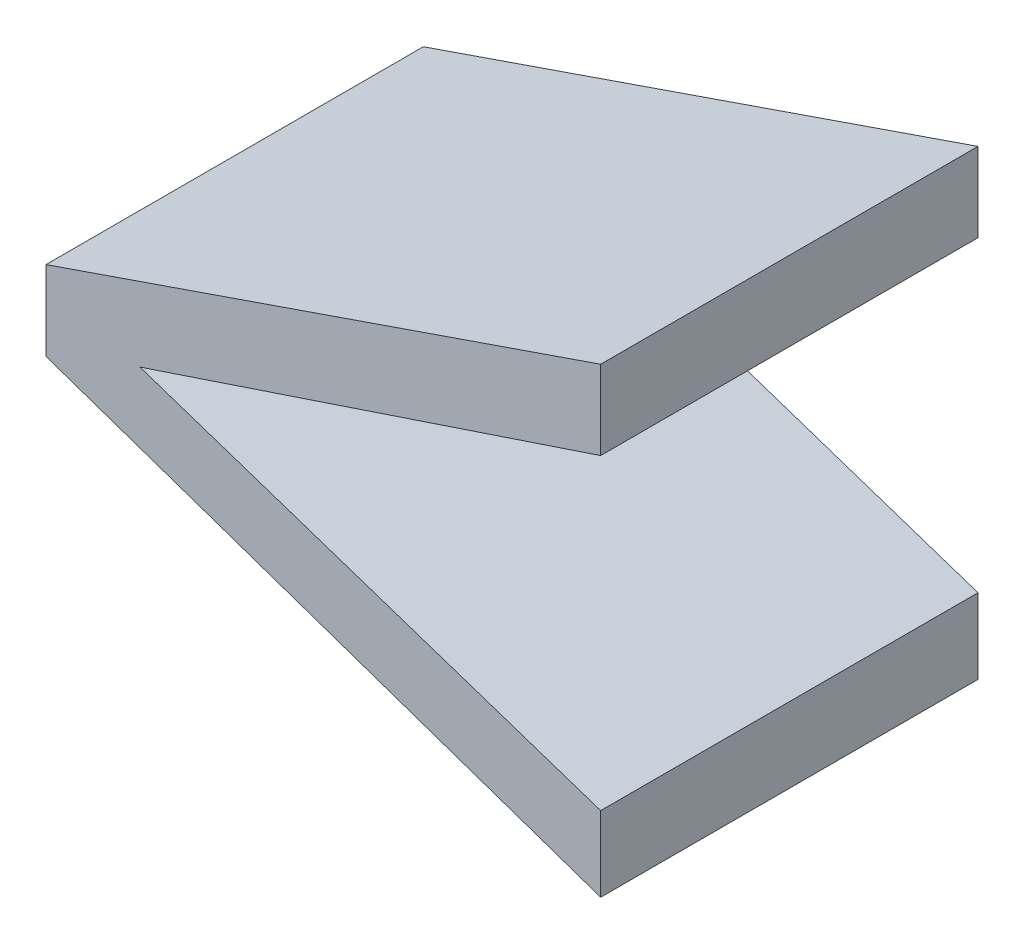
ISO-10303-21;
HEADER;
FILE_DESCRIPTION(('STEP AP214'),'2;1');
FILE_NAME('part.step','',(''),(''),'','','');
FILE_SCHEMA(('AUTOMOTIVE_DESIGN { 1 0 10303 214 1 1 1 1 }'));
ENDSEC;
DATA;
#1=APPLICATION_CONTEXT('core data for automotive mechanical design processes');
#2=APPLICATION_PROTOCOL_DEFINITION('international standard','automotive_design',2000,#1);
#3=PRODUCT_CONTEXT('',#1,'mechanical');
#4=PRODUCT('Part','Part','',(#3));
#5=PRODUCT_RELATED_PRODUCT_CATEGORY('part','',(#4));
#6=PRODUCT_DEFINITION_FORMATION('','',#4);
#7=PRODUCT_DEFINITION_CONTEXT('part definition',#1,'design');
#8=PRODUCT_DEFINITION('design','',#6,#7);
#9=PRODUCT_DEFINITION_SHAPE('','',#8);
#10=(LENGTH_UNIT() NAMED_UNIT(*) SI_UNIT(.MILLI.,.METRE.));
#11=(NAMED_UNIT(*) PLANE_ANGLE_UNIT() SI_UNIT($,.RADIAN.));
#12=(NAMED_UNIT(*) SI_UNIT($,.STERADIAN.) SOLID_ANGLE_UNIT());
#13=UNCERTAINTY_MEASURE_WITH_UNIT(LENGTH_MEASURE(1.E-05),#10,'distance_accuracy_value','');
#14=(GEOMETRIC_REPRESENTATION_CONTEXT(3) GLOBAL_UNCERTAINTY_ASSIGNED_CONTEXT((#13)) GLOBAL_UNIT_ASSIGNED_CONTEXT((#10,
#11,#12)) REPRESENTATION_CONTEXT('',''));
#15=CARTESIAN_POINT('',(0.,0.,0.));
#16=DIRECTION('',(0.,0.,1.));
#17=DIRECTION('',(1.,0.,0.));
#18=AXIS2_PLACEMENT_3D('',#15,#16,#17);
#19=CARTESIAN_POINT('',(-0.198338464719741,-0.802044185635566,0.));
#20=DIRECTION('',(-1.,0.,0.));
#21=DIRECTION('',(0.,-1.,0.));
#22=AXIS2_PLACEMENT_3D('',#19,#20,#21);
#23=PLANE('',#22);
#24=DIRECTION('',(0.,1.,0.));
#25=VECTOR('',#24,1.);
#26=CARTESIAN_POINT('',(-0.198338464719741,-0.823129276362494,0.));
#27=LINE('',#26,#25);
#28=CARTESIAN_POINT('',(-0.198338464719741,-0.823129276362494,0.));
#29=VERTEX_POINT('',#28);
#30=CARTESIAN_POINT('',(-0.198338464719741,-0.802044185635566,0.));
#31=VERTEX_POINT('',#30);
#32=EDGE_CURVE('E11',#29,#31,#27,.T.);
#33=ORIENTED_EDGE('',*,*,#32,.F.);
#34=DIRECTION('',(0.,0.,1.));
#35=VECTOR('',#34,1.);
#36=CARTESIAN_POINT('',(-0.198338464719741,-0.823129276362494,0.));
#37=LINE('',#36,#35);
#38=CARTESIAN_POINT('',(-0.198338464719741,-0.823129276362494,0.1));
#39=VERTEX_POINT('',#38);
#40=EDGE_CURVE('E131',#29,#39,#37,.T.);
#41=ORIENTED_EDGE('',*,*,#40,.T.);
#42=DIRECTION('',(0.,-1.,0.));
#43=VECTOR('',#42,1.);
#44=CARTESIAN_POINT('',(-0.198338464719741,-0.802044185635566,0.1));
#45=LINE('',#44,#43);
#46=CARTESIAN_POINT('',(-0.198338464719741,-0.802044185635566,0.1));
#47=VERTEX_POINT('',#46);
#48=EDGE_CURVE('E97',#47,#39,#45,.T.);
#49=ORIENTED_EDGE('',*,*,#48,.F.);
#50=DIRECTION('',(0.,0.,1.));
#51=VECTOR('',#50,1.);
#52=CARTESIAN_POINT('',(-0.198338464719741,-0.802044185635566,0.));
#53=LINE('',#52,#51);
#54=EDGE_CURVE('E126',#31,#47,#53,.T.);
#55=ORIENTED_EDGE('',*,*,#54,.F.);
#56=EDGE_LOOP('',(#33,#41,#49,#55));
#57=FACE_BOUND('',#56,.T.);
#58=ADVANCED_FACE('F17',(#57),#23,.T.);
#59=CARTESIAN_POINT('',(-0.0513384536630792,-0.751416142929666,0.));
#60=DIRECTION('',(-0.325636464372624,0.945495051848976,0.));
#61=DIRECTION('',(-0.945495051848976,-0.325636464372624,0.));
#62=AXIS2_PLACEMENT_3D('',#59,#60,#61);
#63=PLANE('',#62);
#64=DIRECTION('',(0.945495051848975,0.325636464372624,0.));
#65=VECTOR('',#64,1.);
#66=CARTESIAN_POINT('',(-0.198338464719741,-0.802044185635566,0.));
#67=LINE('',#66,#65);
#68=CARTESIAN_POINT('',(-0.0513384536630792,-0.751416142929666,0.));
#69=VERTEX_POINT('',#68);
#70=EDGE_CURVE('E24',#31,#69,#67,.T.);
#71=ORIENTED_EDGE('',*,*,#70,.F.);
#72=ORIENTED_EDGE('',*,*,#54,.T.);
#73=DIRECTION('',(-0.945495051848975,-0.325636464372624,0.));
#74=VECTOR('',#73,1.);
#75=CARTESIAN_POINT('',(-0.0513384536630795,-0.751416142929665,0.1));
#76=LINE('',#75,#74);
#77=CARTESIAN_POINT('',(-0.0513384536630792,-0.751416142929666,0.1));
#78=VERTEX_POINT('',#77);
#79=EDGE_CURVE('E118',#78,#47,#76,.T.);
#80=ORIENTED_EDGE('',*,*,#79,.F.);
#81=DIRECTION('',(0.,0.,1.));
#82=VECTOR('',#81,1.);
#83=CARTESIAN_POINT('',(-0.0513384536630792,-0.751416142929666,0.));
#84=LINE('',#83,#82);
#85=EDGE_CURVE('E120',#69,#78,#84,.T.);
#86=ORIENTED_EDGE('',*,*,#85,.F.);
#87=EDGE_LOOP('',(#71,#72,#80,#86));
#88=FACE_BOUND('',#87,.T.);
#89=ADVANCED_FACE('F136',(#88),#63,.T.);
#90=CARTESIAN_POINT('',(-0.0513384536630791,-0.772382108850227,0.));
#91=DIRECTION('',(1.,0.,0.));
#92=DIRECTION('',(0.,1.,0.));
#93=AXIS2_PLACEMENT_3D('',#90,#91,#92);
#94=PLANE('',#93);
#95=DIRECTION('',(0.,-1.,0.));
#96=VECTOR('',#95,1.);
#97=CARTESIAN_POINT('',(-0.0513384536630792,-0.751416142929666,0.));
#98=LINE('',#97,#96);
#99=CARTESIAN_POINT('',(-0.0513384536630791,-0.772382108850227,0.));
#100=VERTEX_POINT('',#99);
#101=EDGE_CURVE('E128',#69,#100,#98,.T.);
#102=ORIENTED_EDGE('',*,*,#101,.F.);
#103=ORIENTED_EDGE('',*,*,#85,.T.);
#104=DIRECTION('',(0.,1.,0.));
#105=VECTOR('',#104,1.);
#106=CARTESIAN_POINT('',(-0.0513384536630791,-0.772382108850227,0.1));
#107=LINE('',#106,#105);
#108=CARTESIAN_POINT('',(-0.0513384536630791,-0.772382108850227,0.1));
#109=VERTEX_POINT('',#108);
#110=EDGE_CURVE('E110',#109,#78,#107,.T.);
#111=ORIENTED_EDGE('',*,*,#110,.F.);
#112=DIRECTION('',(0.,0.,1.));
#113=VECTOR('',#112,1.);
#114=CARTESIAN_POINT('',(-0.0513384536630791,-0.772382108850227,0.));
#115=LINE('',#114,#113);
#116=EDGE_CURVE('E113',#100,#109,#115,.T.);
#117=ORIENTED_EDGE('',*,*,#116,.F.);
#118=EDGE_LOOP('',(#102,#103,#111,#117));
#119=FACE_BOUND('',#118,.T.);
#120=ADVANCED_FACE('F138',(#119),#94,.T.);
#121=CARTESIAN_POINT('',(-0.173441380189074,-0.813122792627681,0.));
#122=DIRECTION('',(0.316505388780875,-0.948590711989458,0.));
#123=DIRECTION('',(0.948590711989458,0.316505388780875,0.));
#124=AXIS2_PLACEMENT_3D('',#121,#122,#123);
#125=PLANE('',#124);
#126=DIRECTION('',(-0.948590711989458,-0.316505388780874,0.));
#127=VECTOR('',#126,1.);
#128=CARTESIAN_POINT('',(-0.0513384536630791,-0.772382108850227,0.));
#129=LINE('',#128,#127);
#130=CARTESIAN_POINT('',(-0.173441380189074,-0.813122792627681,0.));
#131=VERTEX_POINT('',#130);
#132=EDGE_CURVE('E122',#100,#131,#129,.T.);
#133=ORIENTED_EDGE('',*,*,#132,.F.);
#134=ORIENTED_EDGE('',*,*,#116,.T.);
#135=DIRECTION('',(0.948590711989458,0.316505388780875,0.));
#136=VECTOR('',#135,1.);
#137=CARTESIAN_POINT('',(-0.173441380189074,-0.813122792627681,0.1));
#138=LINE('',#137,#136);
#139=CARTESIAN_POINT('',(-0.173441380189074,-0.813122792627681,0.1));
#140=VERTEX_POINT('',#139);
#141=EDGE_CURVE('E103',#140,#109,#138,.T.);
#142=ORIENTED_EDGE('',*,*,#141,.F.);
#143=DIRECTION('',(0.,0.,1.));
#144=VECTOR('',#143,1.);
#145=CARTESIAN_POINT('',(-0.173441380189074,-0.813122792627681,0.));
#146=LINE('',#145,#144);
#147=EDGE_CURVE('E106',#131,#140,#146,.T.);
#148=ORIENTED_EDGE('',*,*,#147,.F.);
#149=EDGE_LOOP('',(#133,#134,#142,#148));
#150=FACE_BOUND('',#149,.T.);
#151=ADVANCED_FACE('F142',(#150),#125,.T.);
#152=CARTESIAN_POINT('',(-0.0513384536630789,-0.853863476405135,0.));
#153=DIRECTION('',(0.31650538878087,0.94859071198946,0.));
#154=DIRECTION('',(-0.94859071198946,0.31650538878087,0.));
#155=AXIS2_PLACEMENT_3D('',#152,#153,#154);
#156=PLANE('',#155);
#157=DIRECTION('',(0.94859071198946,-0.31650538878087,0.));
#158=VECTOR('',#157,1.);
#159=CARTESIAN_POINT('',(-0.173441380189074,-0.813122792627681,0.));
#160=LINE('',#159,#158);
#161=CARTESIAN_POINT('',(-0.0513384536630789,-0.853863476405135,0.));
#162=VERTEX_POINT('',#161);
#163=EDGE_CURVE('E115',#131,#162,#160,.T.);
#164=ORIENTED_EDGE('',*,*,#163,.F.);
#165=ORIENTED_EDGE('',*,*,#147,.T.);
#166=DIRECTION('',(-0.94859071198946,0.31650538878087,0.));
#167=VECTOR('',#166,1.);
#168=CARTESIAN_POINT('',(-0.0513384536630787,-0.853863476405134,0.1));
#169=LINE('',#168,#167);
#170=CARTESIAN_POINT('',(-0.0513384536630789,-0.853863476405135,0.1));
#171=VERTEX_POINT('',#170);
#172=EDGE_CURVE('E83',#171,#140,#169,.T.);
#173=ORIENTED_EDGE('',*,*,#172,.F.);
#174=DIRECTION('',(0.,0.,1.));
#175=VECTOR('',#174,1.);
#176=CARTESIAN_POINT('',(-0.0513384536630789,-0.853863476405135,0.));
#177=LINE('',#176,#175);
#178=EDGE_CURVE('E89',#162,#171,#177,.T.);
#179=ORIENTED_EDGE('',*,*,#178,.F.);
#180=EDGE_LOOP('',(#164,#165,#173,#179));
#181=FACE_BOUND('',#180,.T.);
#182=ADVANCED_FACE('F145',(#181),#156,.T.);
#183=CARTESIAN_POINT('',(-0.0513384536630789,-0.873757319068394,0.));
#184=DIRECTION('',(1.,0.,0.));
#185=DIRECTION('',(0.,1.,0.));
#186=AXIS2_PLACEMENT_3D('',#183,#184,#185);
#187=PLANE('',#186);
#188=DIRECTION('',(0.,-1.,0.));
#189=VECTOR('',#188,1.);
#190=CARTESIAN_POINT('',(-0.0513384536630789,-0.853863476405135,0.));
#191=LINE('',#190,#189);
#192=CARTESIAN_POINT('',(-0.0513384536630789,-0.873757319068394,0.));
#193=VERTEX_POINT('',#192);
#194=EDGE_CURVE('E108',#162,#193,#191,.T.);
#195=ORIENTED_EDGE('',*,*,#194,.F.);
#196=ORIENTED_EDGE('',*,*,#178,.T.);
#197=DIRECTION('',(0.,1.,0.));
#198=VECTOR('',#197,1.);
#199=CARTESIAN_POINT('',(-0.0513384536630789,-0.873757319068394,0.1));
#200=LINE('',#199,#198);
#201=CARTESIAN_POINT('',(-0.0513384536630789,-0.873757319068394,0.1));
#202=VERTEX_POINT('',#201);
#203=EDGE_CURVE('E84',#202,#171,#200,.T.);
#204=ORIENTED_EDGE('',*,*,#203,.F.);
#205=DIRECTION('',(0.,0.,1.));
#206=VECTOR('',#205,1.);
#207=CARTESIAN_POINT('',(-0.0513384536630789,-0.873757319068394,0.));
#208=LINE('',#207,#206);
#209=EDGE_CURVE('E73',#193,#202,#208,.T.);
#210=ORIENTED_EDGE('',*,*,#209,.F.);
#211=EDGE_LOOP('',(#195,#196,#204,#210));
#212=FACE_BOUND('',#211,.T.);
#213=ADVANCED_FACE('F87',(#212),#187,.T.);
#214=CARTESIAN_POINT('',(-0.198338464719741,-0.823129276362494,0.));
#215=DIRECTION('',(-0.325636464372619,-0.945495051848977,0.));
#216=DIRECTION('',(0.945495051848977,-0.325636464372619,0.));
#217=AXIS2_PLACEMENT_3D('',#214,#215,#216);
#218=PLANE('',#217);
#219=DIRECTION('',(-0.945495051848977,0.325636464372619,0.));
#220=VECTOR('',#219,1.);
#221=CARTESIAN_POINT('',(-0.0513384536630789,-0.873757319068394,0.));
#222=LINE('',#221,#220);
#223=EDGE_CURVE('E80',#193,#29,#222,.T.);
#224=ORIENTED_EDGE('',*,*,#223,.F.);
#225=ORIENTED_EDGE('',*,*,#209,.T.);
#226=DIRECTION('',(0.945495051848977,-0.325636464372618,0.));
#227=VECTOR('',#226,1.);
#228=CARTESIAN_POINT('',(-0.198338464719741,-0.823129276362494,0.1));
#229=LINE('',#228,#227);
#230=EDGE_CURVE('E78',#39,#202,#229,.T.);
#231=ORIENTED_EDGE('',*,*,#230,.F.);
#232=ORIENTED_EDGE('',*,*,#40,.F.);
#233=EDGE_LOOP('',(#224,#225,#231,#232));
#234=FACE_BOUND('',#233,.T.);
#235=ADVANCED_FACE('F75',(#234),#218,.T.);
#236=CARTESIAN_POINT('',(-0.117448401737778,-0.812736373995968,0.));
#237=DIRECTION('',(0.,0.,1.));
#238=DIRECTION('',(1.,0.,0.));
#239=AXIS2_PLACEMENT_3D('',#236,#237,#238);
#240=PLANE('',#239);
#241=ORIENTED_EDGE('',*,*,#223,.T.);
#242=ORIENTED_EDGE('',*,*,#32,.T.);
#243=ORIENTED_EDGE('',*,*,#70,.T.);
#244=ORIENTED_EDGE('',*,*,#101,.T.);
#245=ORIENTED_EDGE('',*,*,#132,.T.);
#246=ORIENTED_EDGE('',*,*,#163,.T.);
#247=ORIENTED_EDGE('',*,*,#194,.T.);
#248=EDGE_LOOP('',(#241,#242,#243,#244,#245,#246,#247));
#249=FACE_BOUND('',#248,.T.);
#250=ADVANCED_FACE('F133',(#249),#240,.F.);
#251=CARTESIAN_POINT('',(-0.117448401737778,-0.812736373995968,0.1));
#252=DIRECTION('',(0.,0.,1.));
#253=DIRECTION('',(1.,0.,0.));
#254=AXIS2_PLACEMENT_3D('',#251,#252,#253);
#255=PLANE('',#254);
#256=ORIENTED_EDGE('',*,*,#230,.T.);
#257=ORIENTED_EDGE('',*,*,#203,.T.);
#258=ORIENTED_EDGE('',*,*,#172,.T.);
#259=ORIENTED_EDGE('',*,*,#141,.T.);
#260=ORIENTED_EDGE('',*,*,#110,.T.);
#261=ORIENTED_EDGE('',*,*,#79,.T.);
#262=ORIENTED_EDGE('',*,*,#48,.T.);
#263=EDGE_LOOP('',(#256,#257,#258,#259,#260,#261,#262));
#264=FACE_BOUND('',#263,.T.);
#265=ADVANCED_FACE('F94',(#264),#255,.T.);
#266=CLOSED_SHELL('',(#58,#89,#120,#151,#182,#213,#235,#250,#265));
#267=MANIFOLD_SOLID_BREP('B1',#266);
#268=ADVANCED_BREP_SHAPE_REPRESENTATION('',(#18,#267),#14);
#269=SHAPE_DEFINITION_REPRESENTATION(#9,#268);
ENDSEC;
END-ISO-10303-21;
